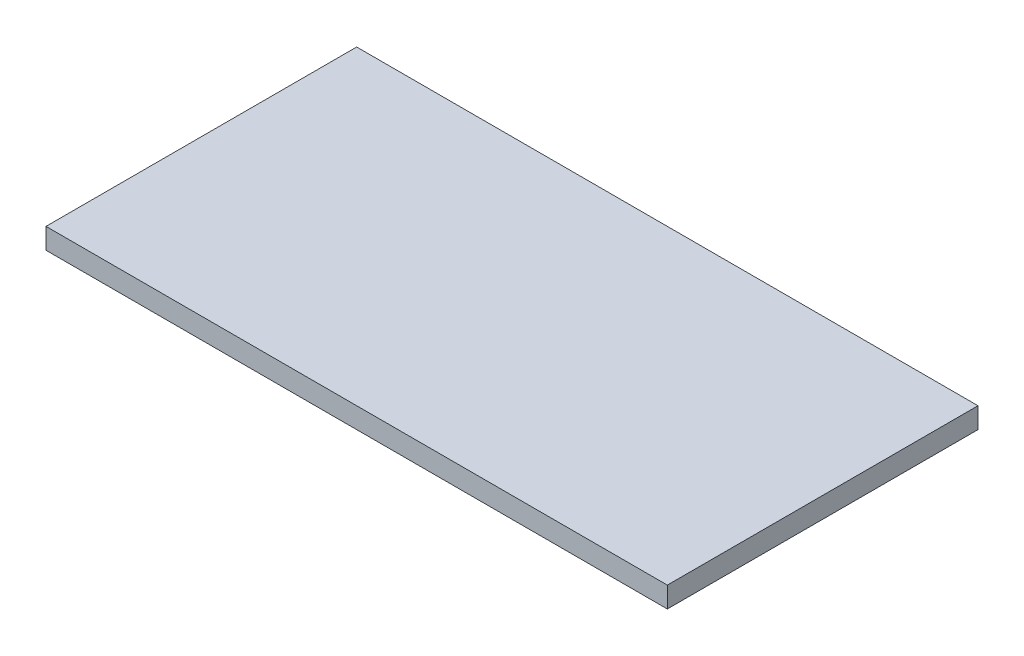
ISO-10303-21;
HEADER;
FILE_DESCRIPTION(('STEP AP214'),'2;1');
FILE_NAME('part.step','',(''),(''),'','','');
FILE_SCHEMA(('AUTOMOTIVE_DESIGN { 1 0 10303 214 1 1 1 1 }'));
ENDSEC;
DATA;
#1=APPLICATION_CONTEXT('core data for automotive mechanical design processes');
#2=APPLICATION_PROTOCOL_DEFINITION('international standard','automotive_design',2000,#1);
#3=PRODUCT_CONTEXT('',#1,'mechanical');
#4=PRODUCT('Part','Part','',(#3));
#5=PRODUCT_RELATED_PRODUCT_CATEGORY('part','',(#4));
#6=PRODUCT_DEFINITION_FORMATION('','',#4);
#7=PRODUCT_DEFINITION_CONTEXT('part definition',#1,'design');
#8=PRODUCT_DEFINITION('design','',#6,#7);
#9=PRODUCT_DEFINITION_SHAPE('','',#8);
#10=(LENGTH_UNIT() NAMED_UNIT(*) SI_UNIT(.MILLI.,.METRE.));
#11=(NAMED_UNIT(*) PLANE_ANGLE_UNIT() SI_UNIT($,.RADIAN.));
#12=(NAMED_UNIT(*) SI_UNIT($,.STERADIAN.) SOLID_ANGLE_UNIT());
#13=UNCERTAINTY_MEASURE_WITH_UNIT(LENGTH_MEASURE(1.E-05),#10,'distance_accuracy_value','');
#14=(GEOMETRIC_REPRESENTATION_CONTEXT(3) GLOBAL_UNCERTAINTY_ASSIGNED_CONTEXT((#13)) GLOBAL_UNIT_ASSIGNED_CONTEXT((#10,
#11,#12)) REPRESENTATION_CONTEXT('',''));
#15=CARTESIAN_POINT('',(0.,0.,0.));
#16=DIRECTION('',(0.,0.,1.));
#17=DIRECTION('',(1.,0.,0.));
#18=AXIS2_PLACEMENT_3D('',#15,#16,#17);
#19=CARTESIAN_POINT('',(0.,10.,0.));
#20=DIRECTION('',(1.,0.,0.));
#21=DIRECTION('',(0.,0.,-1.));
#22=AXIS2_PLACEMENT_3D('',#19,#20,#21);
#23=PLANE('',#22);
#24=DIRECTION('',(0.,0.,1.));
#25=VECTOR('',#24,1.);
#26=CARTESIAN_POINT('',(0.,0.,0.));
#27=LINE('',#26,#25);
#28=CARTESIAN_POINT('',(0.,0.,-150.));
#29=VERTEX_POINT('',#28);
#30=CARTESIAN_POINT('',(0.,0.,0.));
#31=VERTEX_POINT('',#30);
#32=EDGE_CURVE('E100',#29,#31,#27,.T.);
#33=ORIENTED_EDGE('',*,*,#32,.T.);
#34=DIRECTION('',(0.,-1.,0.));
#35=VECTOR('',#34,1.);
#36=CARTESIAN_POINT('',(0.,10.,0.));
#37=LINE('',#36,#35);
#38=CARTESIAN_POINT('',(0.,10.,0.));
#39=VERTEX_POINT('',#38);
#40=EDGE_CURVE('E11',#39,#31,#37,.T.);
#41=ORIENTED_EDGE('',*,*,#40,.F.);
#42=DIRECTION('',(0.,0.,1.));
#43=VECTOR('',#42,1.);
#44=CARTESIAN_POINT('',(0.,10.,0.));
#45=LINE('',#44,#43);
#46=CARTESIAN_POINT('',(0.,10.,-150.));
#47=VERTEX_POINT('',#46);
#48=EDGE_CURVE('E88',#47,#39,#45,.T.);
#49=ORIENTED_EDGE('',*,*,#48,.F.);
#50=DIRECTION('',(0.,-1.,0.));
#51=VECTOR('',#50,1.);
#52=CARTESIAN_POINT('',(0.,10.,-150.));
#53=LINE('',#52,#51);
#54=EDGE_CURVE('E96',#47,#29,#53,.T.);
#55=ORIENTED_EDGE('',*,*,#54,.T.);
#56=EDGE_LOOP('',(#33,#41,#49,#55));
#57=FACE_BOUND('',#56,.T.);
#58=ADVANCED_FACE('F37',(#57),#23,.F.);
#59=CARTESIAN_POINT('',(0.,10.,0.));
#60=DIRECTION('',(0.,0.,-1.));
#61=DIRECTION('',(-1.,0.,0.));
#62=AXIS2_PLACEMENT_3D('',#59,#60,#61);
#63=PLANE('',#62);
#64=DIRECTION('',(1.,0.,0.));
#65=VECTOR('',#64,1.);
#66=CARTESIAN_POINT('',(0.,0.,0.));
#67=LINE('',#66,#65);
#68=CARTESIAN_POINT('',(300.,0.,0.));
#69=VERTEX_POINT('',#68);
#70=EDGE_CURVE('E92',#31,#69,#67,.T.);
#71=ORIENTED_EDGE('',*,*,#70,.T.);
#72=DIRECTION('',(0.,-1.,0.));
#73=VECTOR('',#72,1.);
#74=CARTESIAN_POINT('',(300.,10.,0.));
#75=LINE('',#74,#73);
#76=CARTESIAN_POINT('',(300.,10.,0.));
#77=VERTEX_POINT('',#76);
#78=EDGE_CURVE('E45',#77,#69,#75,.T.);
#79=ORIENTED_EDGE('',*,*,#78,.F.);
#80=DIRECTION('',(1.,0.,0.));
#81=VECTOR('',#80,1.);
#82=CARTESIAN_POINT('',(0.,10.,0.));
#83=LINE('',#82,#81);
#84=EDGE_CURVE('E83',#39,#77,#83,.T.);
#85=ORIENTED_EDGE('',*,*,#84,.F.);
#86=ORIENTED_EDGE('',*,*,#40,.T.);
#87=EDGE_LOOP('',(#71,#79,#85,#86));
#88=FACE_BOUND('',#87,.T.);
#89=ADVANCED_FACE('F91',(#88),#63,.F.);
#90=CARTESIAN_POINT('',(300.,10.,0.));
#91=DIRECTION('',(-1.,0.,0.));
#92=DIRECTION('',(0.,0.,1.));
#93=AXIS2_PLACEMENT_3D('',#90,#91,#92);
#94=PLANE('',#93);
#95=DIRECTION('',(0.,0.,-1.));
#96=VECTOR('',#95,1.);
#97=CARTESIAN_POINT('',(300.,0.,0.));
#98=LINE('',#97,#96);
#99=CARTESIAN_POINT('',(300.,0.,-150.));
#100=VERTEX_POINT('',#99);
#101=EDGE_CURVE('E70',#69,#100,#98,.T.);
#102=ORIENTED_EDGE('',*,*,#101,.T.);
#103=DIRECTION('',(0.,-1.,0.));
#104=VECTOR('',#103,1.);
#105=CARTESIAN_POINT('',(300.,10.,-150.));
#106=LINE('',#105,#104);
#107=CARTESIAN_POINT('',(300.,10.,-150.));
#108=VERTEX_POINT('',#107);
#109=EDGE_CURVE('E93',#108,#100,#106,.T.);
#110=ORIENTED_EDGE('',*,*,#109,.F.);
#111=DIRECTION('',(0.,0.,-1.));
#112=VECTOR('',#111,1.);
#113=CARTESIAN_POINT('',(300.,10.,0.));
#114=LINE('',#113,#112);
#115=EDGE_CURVE('E86',#77,#108,#114,.T.);
#116=ORIENTED_EDGE('',*,*,#115,.F.);
#117=ORIENTED_EDGE('',*,*,#78,.T.);
#118=EDGE_LOOP('',(#102,#110,#116,#117));
#119=FACE_BOUND('',#118,.T.);
#120=ADVANCED_FACE('F94',(#119),#94,.F.);
#121=CARTESIAN_POINT('',(0.,10.,-150.));
#122=DIRECTION('',(0.,0.,1.));
#123=DIRECTION('',(1.,0.,0.));
#124=AXIS2_PLACEMENT_3D('',#121,#122,#123);
#125=PLANE('',#124);
#126=DIRECTION('',(-1.,0.,0.));
#127=VECTOR('',#126,1.);
#128=CARTESIAN_POINT('',(0.,0.,-150.));
#129=LINE('',#128,#127);
#130=EDGE_CURVE('E76',#100,#29,#129,.T.);
#131=ORIENTED_EDGE('',*,*,#130,.T.);
#132=ORIENTED_EDGE('',*,*,#54,.F.);
#133=DIRECTION('',(-1.,0.,0.));
#134=VECTOR('',#133,1.);
#135=CARTESIAN_POINT('',(0.,10.,-150.));
#136=LINE('',#135,#134);
#137=EDGE_CURVE('E53',#108,#47,#136,.T.);
#138=ORIENTED_EDGE('',*,*,#137,.F.);
#139=ORIENTED_EDGE('',*,*,#109,.T.);
#140=EDGE_LOOP('',(#131,#132,#138,#139));
#141=FACE_BOUND('',#140,.T.);
#142=ADVANCED_FACE('F107',(#141),#125,.F.);
#143=CARTESIAN_POINT('',(0.,10.,0.));
#144=DIRECTION('',(0.,-1.,0.));
#145=DIRECTION('',(0.,0.,-1.));
#146=AXIS2_PLACEMENT_3D('',#143,#144,#145);
#147=PLANE('',#146);
#148=ORIENTED_EDGE('',*,*,#48,.T.);
#149=ORIENTED_EDGE('',*,*,#84,.T.);
#150=ORIENTED_EDGE('',*,*,#115,.T.);
#151=ORIENTED_EDGE('',*,*,#137,.T.);
#152=EDGE_LOOP('',(#148,#149,#150,#151));
#153=FACE_BOUND('',#152,.T.);
#154=ADVANCED_FACE('F84',(#153),#147,.F.);
#155=CARTESIAN_POINT('',(0.,0.,0.));
#156=DIRECTION('',(0.,-1.,0.));
#157=DIRECTION('',(0.,0.,-1.));
#158=AXIS2_PLACEMENT_3D('',#155,#156,#157);
#159=PLANE('',#158);
#160=ORIENTED_EDGE('',*,*,#32,.F.);
#161=ORIENTED_EDGE('',*,*,#130,.F.);
#162=ORIENTED_EDGE('',*,*,#101,.F.);
#163=ORIENTED_EDGE('',*,*,#70,.F.);
#164=EDGE_LOOP('',(#160,#161,#162,#163));
#165=FACE_BOUND('',#164,.T.);
#166=ADVANCED_FACE('F110',(#165),#159,.T.);
#167=CLOSED_SHELL('',(#58,#89,#120,#142,#154,#166));
#168=MANIFOLD_SOLID_BREP('B2',#167);
#169=ADVANCED_BREP_SHAPE_REPRESENTATION('',(#18,#168),#14);
#170=SHAPE_DEFINITION_REPRESENTATION(#9,#169);
ENDSEC;
END-ISO-10303-21;
